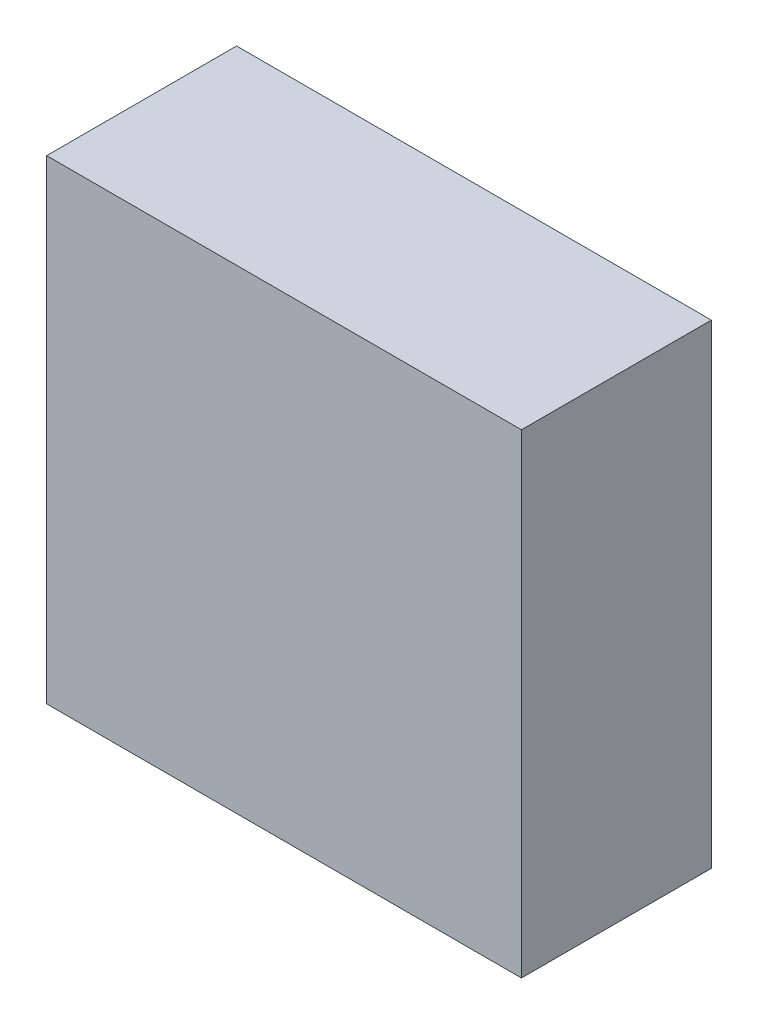
ISO-10303-21;
HEADER;
FILE_DESCRIPTION(('STEP AP214'),'2;1');
FILE_NAME('part.step','',(''),(''),'','','');
FILE_SCHEMA(('AUTOMOTIVE_DESIGN { 1 0 10303 214 1 1 1 1 }'));
ENDSEC;
DATA;
#1=APPLICATION_CONTEXT('core data for automotive mechanical design processes');
#2=APPLICATION_PROTOCOL_DEFINITION('international standard','automotive_design',2000,#1);
#3=PRODUCT_CONTEXT('',#1,'mechanical');
#4=PRODUCT('Part','Part','',(#3));
#5=PRODUCT_RELATED_PRODUCT_CATEGORY('part','',(#4));
#6=PRODUCT_DEFINITION_FORMATION('','',#4);
#7=PRODUCT_DEFINITION_CONTEXT('part definition',#1,'design');
#8=PRODUCT_DEFINITION('design','',#6,#7);
#9=PRODUCT_DEFINITION_SHAPE('','',#8);
#10=(LENGTH_UNIT() NAMED_UNIT(*) SI_UNIT(.MILLI.,.METRE.));
#11=(NAMED_UNIT(*) PLANE_ANGLE_UNIT() SI_UNIT($,.RADIAN.));
#12=(NAMED_UNIT(*) SI_UNIT($,.STERADIAN.) SOLID_ANGLE_UNIT());
#13=UNCERTAINTY_MEASURE_WITH_UNIT(LENGTH_MEASURE(1.E-05),#10,'distance_accuracy_value','');
#14=(GEOMETRIC_REPRESENTATION_CONTEXT(3) GLOBAL_UNCERTAINTY_ASSIGNED_CONTEXT((#13)) GLOBAL_UNIT_ASSIGNED_CONTEXT((#10,
#11,#12)) REPRESENTATION_CONTEXT('',''));
#15=CARTESIAN_POINT('',(0.,0.,0.));
#16=DIRECTION('',(0.,0.,1.));
#17=DIRECTION('',(1.,0.,0.));
#18=AXIS2_PLACEMENT_3D('',#15,#16,#17);
#19=CARTESIAN_POINT('',(0.,0.,0.));
#20=DIRECTION('',(0.,0.,-1.));
#21=DIRECTION('',(-1.,0.,0.));
#22=AXIS2_PLACEMENT_3D('',#19,#20,#21);
#23=PLANE('',#22);
#24=DIRECTION('',(0.,1.,0.));
#25=VECTOR('',#24,1.);
#26=CARTESIAN_POINT('',(7.5,-7.5,0.));
#27=LINE('',#26,#25);
#28=CARTESIAN_POINT('',(7.5,-7.5,0.));
#29=VERTEX_POINT('',#28);
#30=CARTESIAN_POINT('',(7.5,7.5,0.));
#31=VERTEX_POINT('',#30);
#32=EDGE_CURVE('E380',#29,#31,#27,.T.);
#33=ORIENTED_EDGE('',*,*,#32,.F.);
#34=DIRECTION('',(1.,0.,0.));
#35=VECTOR('',#34,1.);
#36=CARTESIAN_POINT('',(-7.5,-7.5,0.));
#37=LINE('',#36,#35);
#38=CARTESIAN_POINT('',(-7.5,-7.5,0.));
#39=VERTEX_POINT('',#38);
#40=EDGE_CURVE('E56',#39,#29,#37,.T.);
#41=ORIENTED_EDGE('',*,*,#40,.F.);
#42=DIRECTION('',(0.,-1.,0.));
#43=VECTOR('',#42,1.);
#44=CARTESIAN_POINT('',(-7.5,-7.5,0.));
#45=LINE('',#44,#43);
#46=CARTESIAN_POINT('',(-7.5,7.5,0.));
#47=VERTEX_POINT('',#46);
#48=EDGE_CURVE('E203',#47,#39,#45,.T.);
#49=ORIENTED_EDGE('',*,*,#48,.F.);
#50=DIRECTION('',(-1.,0.,0.));
#51=VECTOR('',#50,1.);
#52=CARTESIAN_POINT('',(-7.5,7.5,0.));
#53=LINE('',#52,#51);
#54=EDGE_CURVE('E383',#31,#47,#53,.T.);
#55=ORIENTED_EDGE('',*,*,#54,.F.);
#56=EDGE_LOOP('',(#33,#41,#49,#55));
#57=FACE_BOUND('',#56,.T.);
#58=DIRECTION('',(-1.,0.,0.));
#59=VECTOR('',#58,1.);
#60=CARTESIAN_POINT('',(-5.55,5.55,0.));
#61=LINE('',#60,#59);
#62=CARTESIAN_POINT('',(-1.5,5.55,0.));
#63=VERTEX_POINT('',#62);
#64=CARTESIAN_POINT('',(-5.55,5.55,0.));
#65=VERTEX_POINT('',#64);
#66=EDGE_CURVE('E226',#63,#65,#61,.T.);
#67=ORIENTED_EDGE('',*,*,#66,.T.);
#68=DIRECTION('',(0.,-1.,0.));
#69=VECTOR('',#68,1.);
#70=CARTESIAN_POINT('',(-5.55,5.55,0.));
#71=LINE('',#70,#69);
#72=CARTESIAN_POINT('',(-5.55,1.5,0.));
#73=VERTEX_POINT('',#72);
#74=EDGE_CURVE('E48',#65,#73,#71,.T.);
#75=ORIENTED_EDGE('',*,*,#74,.T.);
#76=DIRECTION('',(1.,0.,0.));
#77=VECTOR('',#76,1.);
#78=CARTESIAN_POINT('',(-5.55,1.5,0.));
#79=LINE('',#78,#77);
#80=CARTESIAN_POINT('',(-3.55,1.5,0.));
#81=VERTEX_POINT('',#80);
#82=EDGE_CURVE('E285',#73,#81,#79,.T.);
#83=ORIENTED_EDGE('',*,*,#82,.T.);
#84=DIRECTION('',(0.,-1.,0.));
#85=VECTOR('',#84,1.);
#86=CARTESIAN_POINT('',(-3.55,1.5,0.));
#87=LINE('',#86,#85);
#88=CARTESIAN_POINT('',(-3.55,-1.5,0.));
#89=VERTEX_POINT('',#88);
#90=EDGE_CURVE('E288',#81,#89,#87,.T.);
#91=ORIENTED_EDGE('',*,*,#90,.T.);
#92=DIRECTION('',(-1.,0.,0.));
#93=VECTOR('',#92,1.);
#94=CARTESIAN_POINT('',(-3.55,-1.5,0.));
#95=LINE('',#94,#93);
#96=CARTESIAN_POINT('',(-5.55,-1.5,0.));
#97=VERTEX_POINT('',#96);
#98=EDGE_CURVE('E291',#89,#97,#95,.T.);
#99=ORIENTED_EDGE('',*,*,#98,.T.);
#100=DIRECTION('',(0.,-1.,0.));
#101=VECTOR('',#100,1.);
#102=CARTESIAN_POINT('',(-5.55,-1.5,0.));
#103=LINE('',#102,#101);
#104=CARTESIAN_POINT('',(-5.55,-5.55,0.));
#105=VERTEX_POINT('',#104);
#106=EDGE_CURVE('E294',#97,#105,#103,.T.);
#107=ORIENTED_EDGE('',*,*,#106,.T.);
#108=DIRECTION('',(1.,0.,0.));
#109=VECTOR('',#108,1.);
#110=CARTESIAN_POINT('',(-5.55,-5.55,0.));
#111=LINE('',#110,#109);
#112=CARTESIAN_POINT('',(-1.5,-5.55,0.));
#113=VERTEX_POINT('',#112);
#114=EDGE_CURVE('E297',#105,#113,#111,.T.);
#115=ORIENTED_EDGE('',*,*,#114,.T.);
#116=DIRECTION('',(0.,1.,0.));
#117=VECTOR('',#116,1.);
#118=CARTESIAN_POINT('',(-1.5,-5.55,0.));
#119=LINE('',#118,#117);
#120=CARTESIAN_POINT('',(-1.5,-3.55,0.));
#121=VERTEX_POINT('',#120);
#122=EDGE_CURVE('E300',#113,#121,#119,.T.);
#123=ORIENTED_EDGE('',*,*,#122,.T.);
#124=DIRECTION('',(1.,0.,0.));
#125=VECTOR('',#124,1.);
#126=CARTESIAN_POINT('',(-1.5,-3.55,0.));
#127=LINE('',#126,#125);
#128=CARTESIAN_POINT('',(1.5,-3.55,0.));
#129=VERTEX_POINT('',#128);
#130=EDGE_CURVE('E303',#121,#129,#127,.T.);
#131=ORIENTED_EDGE('',*,*,#130,.T.);
#132=DIRECTION('',(0.,-1.,0.));
#133=VECTOR('',#132,1.);
#134=CARTESIAN_POINT('',(1.5,-3.55,0.));
#135=LINE('',#134,#133);
#136=CARTESIAN_POINT('',(1.5,-5.55,0.));
#137=VERTEX_POINT('',#136);
#138=EDGE_CURVE('E306',#129,#137,#135,.T.);
#139=ORIENTED_EDGE('',*,*,#138,.T.);
#140=DIRECTION('',(1.,0.,0.));
#141=VECTOR('',#140,1.);
#142=CARTESIAN_POINT('',(1.5,-5.55,0.));
#143=LINE('',#142,#141);
#144=CARTESIAN_POINT('',(5.55,-5.55,0.));
#145=VERTEX_POINT('',#144);
#146=EDGE_CURVE('E309',#137,#145,#143,.T.);
#147=ORIENTED_EDGE('',*,*,#146,.T.);
#148=DIRECTION('',(0.,1.,0.));
#149=VECTOR('',#148,1.);
#150=CARTESIAN_POINT('',(5.55,-5.55,0.));
#151=LINE('',#150,#149);
#152=CARTESIAN_POINT('',(5.55,-1.5,0.));
#153=VERTEX_POINT('',#152);
#154=EDGE_CURVE('E312',#145,#153,#151,.T.);
#155=ORIENTED_EDGE('',*,*,#154,.T.);
#156=DIRECTION('',(-1.,0.,0.));
#157=VECTOR('',#156,1.);
#158=CARTESIAN_POINT('',(5.55,-1.5,0.));
#159=LINE('',#158,#157);
#160=CARTESIAN_POINT('',(3.55,-1.5,0.));
#161=VERTEX_POINT('',#160);
#162=EDGE_CURVE('E315',#153,#161,#159,.T.);
#163=ORIENTED_EDGE('',*,*,#162,.T.);
#164=DIRECTION('',(0.,1.,0.));
#165=VECTOR('',#164,1.);
#166=CARTESIAN_POINT('',(3.55,-1.5,0.));
#167=LINE('',#166,#165);
#168=CARTESIAN_POINT('',(3.55,1.5,0.));
#169=VERTEX_POINT('',#168);
#170=EDGE_CURVE('E318',#161,#169,#167,.T.);
#171=ORIENTED_EDGE('',*,*,#170,.T.);
#172=DIRECTION('',(1.,0.,0.));
#173=VECTOR('',#172,1.);
#174=CARTESIAN_POINT('',(3.55,1.5,0.));
#175=LINE('',#174,#173);
#176=CARTESIAN_POINT('',(5.55,1.5,0.));
#177=VERTEX_POINT('',#176);
#178=EDGE_CURVE('E321',#169,#177,#175,.T.);
#179=ORIENTED_EDGE('',*,*,#178,.T.);
#180=DIRECTION('',(0.,1.,0.));
#181=VECTOR('',#180,1.);
#182=CARTESIAN_POINT('',(5.55,5.55,0.));
#183=LINE('',#182,#181);
#184=CARTESIAN_POINT('',(5.55,5.55,0.));
#185=VERTEX_POINT('',#184);
#186=EDGE_CURVE('E324',#177,#185,#183,.T.);
#187=ORIENTED_EDGE('',*,*,#186,.T.);
#188=DIRECTION('',(-1.,0.,0.));
#189=VECTOR('',#188,1.);
#190=CARTESIAN_POINT('',(1.5,5.55,0.));
#191=LINE('',#190,#189);
#192=CARTESIAN_POINT('',(1.5,5.55,0.));
#193=VERTEX_POINT('',#192);
#194=EDGE_CURVE('E327',#185,#193,#191,.T.);
#195=ORIENTED_EDGE('',*,*,#194,.T.);
#196=DIRECTION('',(0.,-1.,0.));
#197=VECTOR('',#196,1.);
#198=CARTESIAN_POINT('',(1.5,3.55,0.));
#199=LINE('',#198,#197);
#200=CARTESIAN_POINT('',(1.5,3.55,0.));
#201=VERTEX_POINT('',#200);
#202=EDGE_CURVE('E330',#193,#201,#199,.T.);
#203=ORIENTED_EDGE('',*,*,#202,.T.);
#204=DIRECTION('',(-1.,0.,0.));
#205=VECTOR('',#204,1.);
#206=CARTESIAN_POINT('',(-1.5,3.55,0.));
#207=LINE('',#206,#205);
#208=CARTESIAN_POINT('',(-1.5,3.55,0.));
#209=VERTEX_POINT('',#208);
#210=EDGE_CURVE('E333',#201,#209,#207,.T.);
#211=ORIENTED_EDGE('',*,*,#210,.T.);
#212=DIRECTION('',(0.,1.,0.));
#213=VECTOR('',#212,1.);
#214=CARTESIAN_POINT('',(-1.5,5.55,0.));
#215=LINE('',#214,#213);
#216=EDGE_CURVE('E336',#209,#63,#215,.T.);
#217=ORIENTED_EDGE('',*,*,#216,.T.);
#218=EDGE_LOOP('',(#67,#75,#83,#91,#99,#107,#115,#123,#131,#139,#147,#155,#163,#171,#179,#187,
#195,#203,#211,#217));
#219=FACE_BOUND('',#218,.T.);
#220=ADVANCED_FACE('F33',(#57,#219),#23,.T.);
#221=CARTESIAN_POINT('',(7.5,-7.5,5.));
#222=DIRECTION('',(-1.,0.,0.));
#223=DIRECTION('',(0.,0.,1.));
#224=AXIS2_PLACEMENT_3D('',#221,#222,#223);
#225=PLANE('',#224);
#226=ORIENTED_EDGE('',*,*,#32,.T.);
#227=DIRECTION('',(0.,0.,-1.));
#228=VECTOR('',#227,1.);
#229=CARTESIAN_POINT('',(7.5,7.5,5.));
#230=LINE('',#229,#228);
#231=CARTESIAN_POINT('',(7.5,7.5,6.));
#232=VERTEX_POINT('',#231);
#233=EDGE_CURVE('E11',#232,#31,#230,.T.);
#234=ORIENTED_EDGE('',*,*,#233,.F.);
#235=DIRECTION('',(0.,1.,0.));
#236=VECTOR('',#235,1.);
#237=CARTESIAN_POINT('',(7.5,7.5,6.));
#238=LINE('',#237,#236);
#239=CARTESIAN_POINT('',(7.5,-7.5,6.));
#240=VERTEX_POINT('',#239);
#241=EDGE_CURVE('E212',#240,#232,#238,.T.);
#242=ORIENTED_EDGE('',*,*,#241,.F.);
#243=DIRECTION('',(0.,0.,-1.));
#244=VECTOR('',#243,1.);
#245=CARTESIAN_POINT('',(7.5,-7.5,5.));
#246=LINE('',#245,#244);
#247=EDGE_CURVE('E204',#240,#29,#246,.T.);
#248=ORIENTED_EDGE('',*,*,#247,.T.);
#249=EDGE_LOOP('',(#226,#234,#242,#248));
#250=FACE_BOUND('',#249,.T.);
#251=ADVANCED_FACE('F35',(#250),#225,.F.);
#252=CARTESIAN_POINT('',(-7.5,7.5,5.));
#253=DIRECTION('',(0.,-1.,0.));
#254=DIRECTION('',(0.,0.,-1.));
#255=AXIS2_PLACEMENT_3D('',#252,#253,#254);
#256=PLANE('',#255);
#257=ORIENTED_EDGE('',*,*,#54,.T.);
#258=DIRECTION('',(0.,0.,-1.));
#259=VECTOR('',#258,1.);
#260=CARTESIAN_POINT('',(-7.5,7.5,5.));
#261=LINE('',#260,#259);
#262=CARTESIAN_POINT('',(-7.5,7.5,6.));
#263=VERTEX_POINT('',#262);
#264=EDGE_CURVE('E41',#263,#47,#261,.T.);
#265=ORIENTED_EDGE('',*,*,#264,.F.);
#266=DIRECTION('',(-1.,0.,0.));
#267=VECTOR('',#266,1.);
#268=CARTESIAN_POINT('',(-7.5,7.5,6.));
#269=LINE('',#268,#267);
#270=EDGE_CURVE('E217',#232,#263,#269,.T.);
#271=ORIENTED_EDGE('',*,*,#270,.F.);
#272=ORIENTED_EDGE('',*,*,#233,.T.);
#273=EDGE_LOOP('',(#257,#265,#271,#272));
#274=FACE_BOUND('',#273,.T.);
#275=ADVANCED_FACE('F392',(#274),#256,.F.);
#276=CARTESIAN_POINT('',(-7.5,-7.5,5.));
#277=DIRECTION('',(1.,0.,0.));
#278=DIRECTION('',(0.,0.,-1.));
#279=AXIS2_PLACEMENT_3D('',#276,#277,#278);
#280=PLANE('',#279);
#281=ORIENTED_EDGE('',*,*,#48,.T.);
#282=DIRECTION('',(0.,0.,-1.));
#283=VECTOR('',#282,1.);
#284=CARTESIAN_POINT('',(-7.5,-7.5,5.));
#285=LINE('',#284,#283);
#286=CARTESIAN_POINT('',(-7.5,-7.5,6.));
#287=VERTEX_POINT('',#286);
#288=EDGE_CURVE('E196',#287,#39,#285,.T.);
#289=ORIENTED_EDGE('',*,*,#288,.F.);
#290=DIRECTION('',(0.,-1.,0.));
#291=VECTOR('',#290,1.);
#292=CARTESIAN_POINT('',(-7.5,7.5,6.));
#293=LINE('',#292,#291);
#294=EDGE_CURVE('E201',#263,#287,#293,.T.);
#295=ORIENTED_EDGE('',*,*,#294,.F.);
#296=ORIENTED_EDGE('',*,*,#264,.T.);
#297=EDGE_LOOP('',(#281,#289,#295,#296));
#298=FACE_BOUND('',#297,.T.);
#299=ADVANCED_FACE('F198',(#298),#280,.F.);
#300=CARTESIAN_POINT('',(-7.5,-7.5,5.));
#301=DIRECTION('',(0.,1.,0.));
#302=DIRECTION('',(0.,0.,1.));
#303=AXIS2_PLACEMENT_3D('',#300,#301,#302);
#304=PLANE('',#303);
#305=ORIENTED_EDGE('',*,*,#40,.T.);
#306=ORIENTED_EDGE('',*,*,#247,.F.);
#307=DIRECTION('',(1.,0.,0.));
#308=VECTOR('',#307,1.);
#309=CARTESIAN_POINT('',(-7.5,-7.5,6.));
#310=LINE('',#309,#308);
#311=EDGE_CURVE('E207',#287,#240,#310,.T.);
#312=ORIENTED_EDGE('',*,*,#311,.F.);
#313=ORIENTED_EDGE('',*,*,#288,.T.);
#314=EDGE_LOOP('',(#305,#306,#312,#313));
#315=FACE_BOUND('',#314,.T.);
#316=ADVANCED_FACE('F208',(#315),#304,.F.);
#317=CARTESIAN_POINT('',(-5.55,5.55,5.));
#318=DIRECTION('',(1.,0.,0.));
#319=DIRECTION('',(0.,0.,-1.));
#320=AXIS2_PLACEMENT_3D('',#317,#318,#319);
#321=PLANE('',#320);
#322=ORIENTED_EDGE('',*,*,#74,.F.);
#323=DIRECTION('',(0.,0.,-1.));
#324=VECTOR('',#323,1.);
#325=CARTESIAN_POINT('',(-5.55,5.55,5.));
#326=LINE('',#325,#324);
#327=CARTESIAN_POINT('',(-5.55,5.55,5.));
#328=VERTEX_POINT('',#327);
#329=EDGE_CURVE('E283',#328,#65,#326,.T.);
#330=ORIENTED_EDGE('',*,*,#329,.F.);
#331=DIRECTION('',(0.,-1.,0.));
#332=VECTOR('',#331,1.);
#333=CARTESIAN_POINT('',(-5.55,5.55,5.));
#334=LINE('',#333,#332);
#335=CARTESIAN_POINT('',(-5.55,1.5,5.));
#336=VERTEX_POINT('',#335);
#337=EDGE_CURVE('E222',#328,#336,#334,.T.);
#338=ORIENTED_EDGE('',*,*,#337,.T.);
#339=DIRECTION('',(0.,0.,-1.));
#340=VECTOR('',#339,1.);
#341=CARTESIAN_POINT('',(-5.55,1.5,5.));
#342=LINE('',#341,#340);
#343=EDGE_CURVE('E378',#336,#73,#342,.T.);
#344=ORIENTED_EDGE('',*,*,#343,.T.);
#345=EDGE_LOOP('',(#322,#330,#338,#344));
#346=FACE_BOUND('',#345,.T.);
#347=ADVANCED_FACE('F405',(#346),#321,.T.);
#348=CARTESIAN_POINT('',(-5.55,1.5,5.));
#349=DIRECTION('',(0.,1.,0.));
#350=DIRECTION('',(0.,0.,1.));
#351=AXIS2_PLACEMENT_3D('',#348,#349,#350);
#352=PLANE('',#351);
#353=ORIENTED_EDGE('',*,*,#82,.F.);
#354=ORIENTED_EDGE('',*,*,#343,.F.);
#355=DIRECTION('',(1.,0.,0.));
#356=VECTOR('',#355,1.);
#357=CARTESIAN_POINT('',(-5.55,1.5,5.));
#358=LINE('',#357,#356);
#359=CARTESIAN_POINT('',(-3.55,1.5,5.));
#360=VERTEX_POINT('',#359);
#361=EDGE_CURVE('E225',#336,#360,#358,.T.);
#362=ORIENTED_EDGE('',*,*,#361,.T.);
#363=DIRECTION('',(0.,0.,-1.));
#364=VECTOR('',#363,1.);
#365=CARTESIAN_POINT('',(-3.55,1.5,5.));
#366=LINE('',#365,#364);
#367=EDGE_CURVE('E376',#360,#81,#366,.T.);
#368=ORIENTED_EDGE('',*,*,#367,.T.);
#369=EDGE_LOOP('',(#353,#354,#362,#368));
#370=FACE_BOUND('',#369,.T.);
#371=ADVANCED_FACE('F411',(#370),#352,.T.);
#372=CARTESIAN_POINT('',(-3.55,1.5,5.));
#373=DIRECTION('',(1.,0.,0.));
#374=DIRECTION('',(0.,1.,0.));
#375=AXIS2_PLACEMENT_3D('',#372,#373,#374);
#376=PLANE('',#375);
#377=ORIENTED_EDGE('',*,*,#90,.F.);
#378=ORIENTED_EDGE('',*,*,#367,.F.);
#379=DIRECTION('',(0.,-1.,0.));
#380=VECTOR('',#379,1.);
#381=CARTESIAN_POINT('',(-3.55,1.5,5.));
#382=LINE('',#381,#380);
#383=CARTESIAN_POINT('',(-3.55,-1.5,5.));
#384=VERTEX_POINT('',#383);
#385=EDGE_CURVE('E229',#360,#384,#382,.T.);
#386=ORIENTED_EDGE('',*,*,#385,.T.);
#387=DIRECTION('',(0.,0.,-1.));
#388=VECTOR('',#387,1.);
#389=CARTESIAN_POINT('',(-3.55,-1.5,5.));
#390=LINE('',#389,#388);
#391=EDGE_CURVE('E374',#384,#89,#390,.T.);
#392=ORIENTED_EDGE('',*,*,#391,.T.);
#393=EDGE_LOOP('',(#377,#378,#386,#392));
#394=FACE_BOUND('',#393,.T.);
#395=ADVANCED_FACE('F415',(#394),#376,.T.);
#396=CARTESIAN_POINT('',(-3.55,-1.5,5.));
#397=DIRECTION('',(0.,-1.,0.));
#398=DIRECTION('',(1.,0.,0.));
#399=AXIS2_PLACEMENT_3D('',#396,#397,#398);
#400=PLANE('',#399);
#401=ORIENTED_EDGE('',*,*,#98,.F.);
#402=ORIENTED_EDGE('',*,*,#391,.F.);
#403=DIRECTION('',(-1.,0.,0.));
#404=VECTOR('',#403,1.);
#405=CARTESIAN_POINT('',(-3.55,-1.5,5.));
#406=LINE('',#405,#404);
#407=CARTESIAN_POINT('',(-5.55,-1.5,5.));
#408=VERTEX_POINT('',#407);
#409=EDGE_CURVE('E232',#384,#408,#406,.T.);
#410=ORIENTED_EDGE('',*,*,#409,.T.);
#411=DIRECTION('',(0.,0.,-1.));
#412=VECTOR('',#411,1.);
#413=CARTESIAN_POINT('',(-5.55,-1.5,5.));
#414=LINE('',#413,#412);
#415=EDGE_CURVE('E372',#408,#97,#414,.T.);
#416=ORIENTED_EDGE('',*,*,#415,.T.);
#417=EDGE_LOOP('',(#401,#402,#410,#416));
#418=FACE_BOUND('',#417,.T.);
#419=ADVANCED_FACE('F420',(#418),#400,.T.);
#420=CARTESIAN_POINT('',(-5.55,-1.5,5.));
#421=DIRECTION('',(1.,0.,0.));
#422=DIRECTION('',(0.,0.,-1.));
#423=AXIS2_PLACEMENT_3D('',#420,#421,#422);
#424=PLANE('',#423);
#425=ORIENTED_EDGE('',*,*,#106,.F.);
#426=ORIENTED_EDGE('',*,*,#415,.F.);
#427=DIRECTION('',(0.,-1.,0.));
#428=VECTOR('',#427,1.);
#429=CARTESIAN_POINT('',(-5.55,-1.5,5.));
#430=LINE('',#429,#428);
#431=CARTESIAN_POINT('',(-5.55,-5.55,5.));
#432=VERTEX_POINT('',#431);
#433=EDGE_CURVE('E235',#408,#432,#430,.T.);
#434=ORIENTED_EDGE('',*,*,#433,.T.);
#435=DIRECTION('',(0.,0.,-1.));
#436=VECTOR('',#435,1.);
#437=CARTESIAN_POINT('',(-5.55,-5.55,5.));
#438=LINE('',#437,#436);
#439=EDGE_CURVE('E370',#432,#105,#438,.T.);
#440=ORIENTED_EDGE('',*,*,#439,.T.);
#441=EDGE_LOOP('',(#425,#426,#434,#440));
#442=FACE_BOUND('',#441,.T.);
#443=ADVANCED_FACE('F426',(#442),#424,.T.);
#444=CARTESIAN_POINT('',(-5.55,-5.55,5.));
#445=DIRECTION('',(0.,1.,0.));
#446=DIRECTION('',(-1.,0.,0.));
#447=AXIS2_PLACEMENT_3D('',#444,#445,#446);
#448=PLANE('',#447);
#449=ORIENTED_EDGE('',*,*,#114,.F.);
#450=ORIENTED_EDGE('',*,*,#439,.F.);
#451=DIRECTION('',(1.,0.,0.));
#452=VECTOR('',#451,1.);
#453=CARTESIAN_POINT('',(-5.55,-5.55,5.));
#454=LINE('',#453,#452);
#455=CARTESIAN_POINT('',(-1.5,-5.55,5.));
#456=VERTEX_POINT('',#455);
#457=EDGE_CURVE('E238',#432,#456,#454,.T.);
#458=ORIENTED_EDGE('',*,*,#457,.T.);
#459=DIRECTION('',(0.,0.,-1.));
#460=VECTOR('',#459,1.);
#461=CARTESIAN_POINT('',(-1.5,-5.55,5.));
#462=LINE('',#461,#460);
#463=EDGE_CURVE('E368',#456,#113,#462,.T.);
#464=ORIENTED_EDGE('',*,*,#463,.T.);
#465=EDGE_LOOP('',(#449,#450,#458,#464));
#466=FACE_BOUND('',#465,.T.);
#467=ADVANCED_FACE('F430',(#466),#448,.T.);
#468=CARTESIAN_POINT('',(-1.5,-5.55,5.));
#469=DIRECTION('',(-1.,0.,0.));
#470=DIRECTION('',(0.,0.,1.));
#471=AXIS2_PLACEMENT_3D('',#468,#469,#470);
#472=PLANE('',#471);
#473=ORIENTED_EDGE('',*,*,#122,.F.);
#474=ORIENTED_EDGE('',*,*,#463,.F.);
#475=DIRECTION('',(0.,1.,0.));
#476=VECTOR('',#475,1.);
#477=CARTESIAN_POINT('',(-1.5,-5.55,5.));
#478=LINE('',#477,#476);
#479=CARTESIAN_POINT('',(-1.5,-3.55,5.));
#480=VERTEX_POINT('',#479);
#481=EDGE_CURVE('E241',#456,#480,#478,.T.);
#482=ORIENTED_EDGE('',*,*,#481,.T.);
#483=DIRECTION('',(0.,0.,-1.));
#484=VECTOR('',#483,1.);
#485=CARTESIAN_POINT('',(-1.5,-3.55,5.));
#486=LINE('',#485,#484);
#487=EDGE_CURVE('E366',#480,#121,#486,.T.);
#488=ORIENTED_EDGE('',*,*,#487,.T.);
#489=EDGE_LOOP('',(#473,#474,#482,#488));
#490=FACE_BOUND('',#489,.T.);
#491=ADVANCED_FACE('F434',(#490),#472,.T.);
#492=CARTESIAN_POINT('',(-1.5,-3.55,5.));
#493=DIRECTION('',(0.,1.,0.));
#494=DIRECTION('',(0.,0.,1.));
#495=AXIS2_PLACEMENT_3D('',#492,#493,#494);
#496=PLANE('',#495);
#497=ORIENTED_EDGE('',*,*,#130,.F.);
#498=ORIENTED_EDGE('',*,*,#487,.F.);
#499=DIRECTION('',(1.,0.,0.));
#500=VECTOR('',#499,1.);
#501=CARTESIAN_POINT('',(-1.5,-3.55,5.));
#502=LINE('',#501,#500);
#503=CARTESIAN_POINT('',(1.5,-3.55,5.));
#504=VERTEX_POINT('',#503);
#505=EDGE_CURVE('E244',#480,#504,#502,.T.);
#506=ORIENTED_EDGE('',*,*,#505,.T.);
#507=DIRECTION('',(0.,0.,-1.));
#508=VECTOR('',#507,1.);
#509=CARTESIAN_POINT('',(1.5,-3.55,5.));
#510=LINE('',#509,#508);
#511=EDGE_CURVE('E364',#504,#129,#510,.T.);
#512=ORIENTED_EDGE('',*,*,#511,.T.);
#513=EDGE_LOOP('',(#497,#498,#506,#512));
#514=FACE_BOUND('',#513,.T.);
#515=ADVANCED_FACE('F438',(#514),#496,.T.);
#516=CARTESIAN_POINT('',(1.5,-3.55,5.));
#517=DIRECTION('',(1.,0.,0.));
#518=DIRECTION('',(0.,0.,-1.));
#519=AXIS2_PLACEMENT_3D('',#516,#517,#518);
#520=PLANE('',#519);
#521=ORIENTED_EDGE('',*,*,#138,.F.);
#522=ORIENTED_EDGE('',*,*,#511,.F.);
#523=DIRECTION('',(0.,-1.,0.));
#524=VECTOR('',#523,1.);
#525=CARTESIAN_POINT('',(1.5,-3.55,5.));
#526=LINE('',#525,#524);
#527=CARTESIAN_POINT('',(1.5,-5.55,5.));
#528=VERTEX_POINT('',#527);
#529=EDGE_CURVE('E247',#504,#528,#526,.T.);
#530=ORIENTED_EDGE('',*,*,#529,.T.);
#531=DIRECTION('',(0.,0.,-1.));
#532=VECTOR('',#531,1.);
#533=CARTESIAN_POINT('',(1.5,-5.55,5.));
#534=LINE('',#533,#532);
#535=EDGE_CURVE('E362',#528,#137,#534,.T.);
#536=ORIENTED_EDGE('',*,*,#535,.T.);
#537=EDGE_LOOP('',(#521,#522,#530,#536));
#538=FACE_BOUND('',#537,.T.);
#539=ADVANCED_FACE('F442',(#538),#520,.T.);
#540=CARTESIAN_POINT('',(1.5,-5.55,5.));
#541=DIRECTION('',(0.,1.,0.));
#542=DIRECTION('',(0.,0.,1.));
#543=AXIS2_PLACEMENT_3D('',#540,#541,#542);
#544=PLANE('',#543);
#545=ORIENTED_EDGE('',*,*,#146,.F.);
#546=ORIENTED_EDGE('',*,*,#535,.F.);
#547=DIRECTION('',(1.,0.,0.));
#548=VECTOR('',#547,1.);
#549=CARTESIAN_POINT('',(1.5,-5.55,5.));
#550=LINE('',#549,#548);
#551=CARTESIAN_POINT('',(5.55,-5.55,5.));
#552=VERTEX_POINT('',#551);
#553=EDGE_CURVE('E250',#528,#552,#550,.T.);
#554=ORIENTED_EDGE('',*,*,#553,.T.);
#555=DIRECTION('',(0.,0.,-1.));
#556=VECTOR('',#555,1.);
#557=CARTESIAN_POINT('',(5.55,-5.55,5.));
#558=LINE('',#557,#556);
#559=EDGE_CURVE('E360',#552,#145,#558,.T.);
#560=ORIENTED_EDGE('',*,*,#559,.T.);
#561=EDGE_LOOP('',(#545,#546,#554,#560));
#562=FACE_BOUND('',#561,.T.);
#563=ADVANCED_FACE('F446',(#562),#544,.T.);
#564=CARTESIAN_POINT('',(5.55,-5.55,5.));
#565=DIRECTION('',(-1.,0.,0.));
#566=DIRECTION('',(0.,0.,1.));
#567=AXIS2_PLACEMENT_3D('',#564,#565,#566);
#568=PLANE('',#567);
#569=ORIENTED_EDGE('',*,*,#154,.F.);
#570=ORIENTED_EDGE('',*,*,#559,.F.);
#571=DIRECTION('',(0.,1.,0.));
#572=VECTOR('',#571,1.);
#573=CARTESIAN_POINT('',(5.55,-5.55,5.));
#574=LINE('',#573,#572);
#575=CARTESIAN_POINT('',(5.55,-1.5,5.));
#576=VERTEX_POINT('',#575);
#577=EDGE_CURVE('E253',#552,#576,#574,.T.);
#578=ORIENTED_EDGE('',*,*,#577,.T.);
#579=DIRECTION('',(0.,0.,-1.));
#580=VECTOR('',#579,1.);
#581=CARTESIAN_POINT('',(5.55,-1.5,5.));
#582=LINE('',#581,#580);
#583=EDGE_CURVE('E358',#576,#153,#582,.T.);
#584=ORIENTED_EDGE('',*,*,#583,.T.);
#585=EDGE_LOOP('',(#569,#570,#578,#584));
#586=FACE_BOUND('',#585,.T.);
#587=ADVANCED_FACE('F450',(#586),#568,.T.);
#588=CARTESIAN_POINT('',(5.55,-1.5,5.));
#589=DIRECTION('',(0.,-1.,0.));
#590=DIRECTION('',(1.,0.,0.));
#591=AXIS2_PLACEMENT_3D('',#588,#589,#590);
#592=PLANE('',#591);
#593=ORIENTED_EDGE('',*,*,#162,.F.);
#594=ORIENTED_EDGE('',*,*,#583,.F.);
#595=DIRECTION('',(-1.,0.,0.));
#596=VECTOR('',#595,1.);
#597=CARTESIAN_POINT('',(5.55,-1.5,5.));
#598=LINE('',#597,#596);
#599=CARTESIAN_POINT('',(3.55,-1.5,5.));
#600=VERTEX_POINT('',#599);
#601=EDGE_CURVE('E256',#576,#600,#598,.T.);
#602=ORIENTED_EDGE('',*,*,#601,.T.);
#603=DIRECTION('',(0.,0.,-1.));
#604=VECTOR('',#603,1.);
#605=CARTESIAN_POINT('',(3.55,-1.5,5.));
#606=LINE('',#605,#604);
#607=EDGE_CURVE('E356',#600,#161,#606,.T.);
#608=ORIENTED_EDGE('',*,*,#607,.T.);
#609=EDGE_LOOP('',(#593,#594,#602,#608));
#610=FACE_BOUND('',#609,.T.);
#611=ADVANCED_FACE('F454',(#610),#592,.T.);
#612=CARTESIAN_POINT('',(3.55,-1.5,5.));
#613=DIRECTION('',(-1.,0.,0.));
#614=DIRECTION('',(0.,0.,1.));
#615=AXIS2_PLACEMENT_3D('',#612,#613,#614);
#616=PLANE('',#615);
#617=ORIENTED_EDGE('',*,*,#170,.F.);
#618=ORIENTED_EDGE('',*,*,#607,.F.);
#619=DIRECTION('',(0.,1.,0.));
#620=VECTOR('',#619,1.);
#621=CARTESIAN_POINT('',(3.55,-1.5,5.));
#622=LINE('',#621,#620);
#623=CARTESIAN_POINT('',(3.55,1.5,5.));
#624=VERTEX_POINT('',#623);
#625=EDGE_CURVE('E259',#600,#624,#622,.T.);
#626=ORIENTED_EDGE('',*,*,#625,.T.);
#627=DIRECTION('',(0.,0.,-1.));
#628=VECTOR('',#627,1.);
#629=CARTESIAN_POINT('',(3.55,1.5,5.));
#630=LINE('',#629,#628);
#631=EDGE_CURVE('E354',#624,#169,#630,.T.);
#632=ORIENTED_EDGE('',*,*,#631,.T.);
#633=EDGE_LOOP('',(#617,#618,#626,#632));
#634=FACE_BOUND('',#633,.T.);
#635=ADVANCED_FACE('F458',(#634),#616,.T.);
#636=CARTESIAN_POINT('',(3.55,1.5,5.));
#637=DIRECTION('',(0.,1.,0.));
#638=DIRECTION('',(0.,0.,1.));
#639=AXIS2_PLACEMENT_3D('',#636,#637,#638);
#640=PLANE('',#639);
#641=ORIENTED_EDGE('',*,*,#178,.F.);
#642=ORIENTED_EDGE('',*,*,#631,.F.);
#643=DIRECTION('',(1.,0.,0.));
#644=VECTOR('',#643,1.);
#645=CARTESIAN_POINT('',(3.55,1.5,5.));
#646=LINE('',#645,#644);
#647=CARTESIAN_POINT('',(5.55,1.5,5.));
#648=VERTEX_POINT('',#647);
#649=EDGE_CURVE('E262',#624,#648,#646,.T.);
#650=ORIENTED_EDGE('',*,*,#649,.T.);
#651=DIRECTION('',(0.,0.,-1.));
#652=VECTOR('',#651,1.);
#653=CARTESIAN_POINT('',(5.55,1.5,5.));
#654=LINE('',#653,#652);
#655=EDGE_CURVE('E352',#648,#177,#654,.T.);
#656=ORIENTED_EDGE('',*,*,#655,.T.);
#657=EDGE_LOOP('',(#641,#642,#650,#656));
#658=FACE_BOUND('',#657,.T.);
#659=ADVANCED_FACE('F462',(#658),#640,.T.);
#660=CARTESIAN_POINT('',(5.55,5.55,5.));
#661=DIRECTION('',(-1.,0.,0.));
#662=DIRECTION('',(0.,0.,1.));
#663=AXIS2_PLACEMENT_3D('',#660,#661,#662);
#664=PLANE('',#663);
#665=ORIENTED_EDGE('',*,*,#186,.F.);
#666=ORIENTED_EDGE('',*,*,#655,.F.);
#667=DIRECTION('',(0.,1.,0.));
#668=VECTOR('',#667,1.);
#669=CARTESIAN_POINT('',(5.55,5.55,5.));
#670=LINE('',#669,#668);
#671=CARTESIAN_POINT('',(5.55,5.55,5.));
#672=VERTEX_POINT('',#671);
#673=EDGE_CURVE('E265',#648,#672,#670,.T.);
#674=ORIENTED_EDGE('',*,*,#673,.T.);
#675=DIRECTION('',(0.,0.,-1.));
#676=VECTOR('',#675,1.);
#677=CARTESIAN_POINT('',(5.55,5.55,5.));
#678=LINE('',#677,#676);
#679=EDGE_CURVE('E350',#672,#185,#678,.T.);
#680=ORIENTED_EDGE('',*,*,#679,.T.);
#681=EDGE_LOOP('',(#665,#666,#674,#680));
#682=FACE_BOUND('',#681,.T.);
#683=ADVANCED_FACE('F466',(#682),#664,.T.);
#684=CARTESIAN_POINT('',(1.5,5.55,5.));
#685=DIRECTION('',(0.,-1.,0.));
#686=DIRECTION('',(0.,0.,-1.));
#687=AXIS2_PLACEMENT_3D('',#684,#685,#686);
#688=PLANE('',#687);
#689=ORIENTED_EDGE('',*,*,#194,.F.);
#690=ORIENTED_EDGE('',*,*,#679,.F.);
#691=DIRECTION('',(-1.,0.,0.));
#692=VECTOR('',#691,1.);
#693=CARTESIAN_POINT('',(1.5,5.55,5.));
#694=LINE('',#693,#692);
#695=CARTESIAN_POINT('',(1.5,5.55,5.));
#696=VERTEX_POINT('',#695);
#697=EDGE_CURVE('E268',#672,#696,#694,.T.);
#698=ORIENTED_EDGE('',*,*,#697,.T.);
#699=DIRECTION('',(0.,0.,-1.));
#700=VECTOR('',#699,1.);
#701=CARTESIAN_POINT('',(1.5,5.55,5.));
#702=LINE('',#701,#700);
#703=EDGE_CURVE('E348',#696,#193,#702,.T.);
#704=ORIENTED_EDGE('',*,*,#703,.T.);
#705=EDGE_LOOP('',(#689,#690,#698,#704));
#706=FACE_BOUND('',#705,.T.);
#707=ADVANCED_FACE('F470',(#706),#688,.T.);
#708=CARTESIAN_POINT('',(1.5,3.55,5.));
#709=DIRECTION('',(1.,0.,0.));
#710=DIRECTION('',(0.,1.,0.));
#711=AXIS2_PLACEMENT_3D('',#708,#709,#710);
#712=PLANE('',#711);
#713=ORIENTED_EDGE('',*,*,#202,.F.);
#714=ORIENTED_EDGE('',*,*,#703,.F.);
#715=DIRECTION('',(0.,-1.,0.));
#716=VECTOR('',#715,1.);
#717=CARTESIAN_POINT('',(1.5,3.55,5.));
#718=LINE('',#717,#716);
#719=CARTESIAN_POINT('',(1.5,3.55,5.));
#720=VERTEX_POINT('',#719);
#721=EDGE_CURVE('E271',#696,#720,#718,.T.);
#722=ORIENTED_EDGE('',*,*,#721,.T.);
#723=DIRECTION('',(0.,0.,-1.));
#724=VECTOR('',#723,1.);
#725=CARTESIAN_POINT('',(1.5,3.55,5.));
#726=LINE('',#725,#724);
#727=EDGE_CURVE('E346',#720,#201,#726,.T.);
#728=ORIENTED_EDGE('',*,*,#727,.T.);
#729=EDGE_LOOP('',(#713,#714,#722,#728));
#730=FACE_BOUND('',#729,.T.);
#731=ADVANCED_FACE('F474',(#730),#712,.T.);
#732=CARTESIAN_POINT('',(-1.5,3.55,5.));
#733=DIRECTION('',(0.,-1.,0.));
#734=DIRECTION('',(0.,0.,-1.));
#735=AXIS2_PLACEMENT_3D('',#732,#733,#734);
#736=PLANE('',#735);
#737=ORIENTED_EDGE('',*,*,#210,.F.);
#738=ORIENTED_EDGE('',*,*,#727,.F.);
#739=DIRECTION('',(-1.,0.,0.));
#740=VECTOR('',#739,1.);
#741=CARTESIAN_POINT('',(-1.5,3.55,5.));
#742=LINE('',#741,#740);
#743=CARTESIAN_POINT('',(-1.5,3.55,5.));
#744=VERTEX_POINT('',#743);
#745=EDGE_CURVE('E274',#720,#744,#742,.T.);
#746=ORIENTED_EDGE('',*,*,#745,.T.);
#747=DIRECTION('',(0.,0.,-1.));
#748=VECTOR('',#747,1.);
#749=CARTESIAN_POINT('',(-1.5,3.55,5.));
#750=LINE('',#749,#748);
#751=EDGE_CURVE('E344',#744,#209,#750,.T.);
#752=ORIENTED_EDGE('',*,*,#751,.T.);
#753=EDGE_LOOP('',(#737,#738,#746,#752));
#754=FACE_BOUND('',#753,.T.);
#755=ADVANCED_FACE('F478',(#754),#736,.T.);
#756=CARTESIAN_POINT('',(-1.5,5.55,5.));
#757=DIRECTION('',(-1.,0.,0.));
#758=DIRECTION('',(0.,-1.,0.));
#759=AXIS2_PLACEMENT_3D('',#756,#757,#758);
#760=PLANE('',#759);
#761=ORIENTED_EDGE('',*,*,#216,.F.);
#762=ORIENTED_EDGE('',*,*,#751,.F.);
#763=DIRECTION('',(0.,1.,0.));
#764=VECTOR('',#763,1.);
#765=CARTESIAN_POINT('',(-1.5,5.55,5.));
#766=LINE('',#765,#764);
#767=CARTESIAN_POINT('',(-1.5,5.55,5.));
#768=VERTEX_POINT('',#767);
#769=EDGE_CURVE('E277',#744,#768,#766,.T.);
#770=ORIENTED_EDGE('',*,*,#769,.T.);
#771=DIRECTION('',(0.,0.,-1.));
#772=VECTOR('',#771,1.);
#773=CARTESIAN_POINT('',(-1.5,5.55,5.));
#774=LINE('',#773,#772);
#775=EDGE_CURVE('E342',#768,#63,#774,.T.);
#776=ORIENTED_EDGE('',*,*,#775,.T.);
#777=EDGE_LOOP('',(#761,#762,#770,#776));
#778=FACE_BOUND('',#777,.T.);
#779=ADVANCED_FACE('F482',(#778),#760,.T.);
#780=CARTESIAN_POINT('',(-5.55,5.55,5.));
#781=DIRECTION('',(0.,-1.,0.));
#782=DIRECTION('',(0.,0.,-1.));
#783=AXIS2_PLACEMENT_3D('',#780,#781,#782);
#784=PLANE('',#783);
#785=ORIENTED_EDGE('',*,*,#66,.F.);
#786=ORIENTED_EDGE('',*,*,#775,.F.);
#787=DIRECTION('',(-1.,0.,0.));
#788=VECTOR('',#787,1.);
#789=CARTESIAN_POINT('',(-5.55,5.55,5.));
#790=LINE('',#789,#788);
#791=EDGE_CURVE('E280',#768,#328,#790,.T.);
#792=ORIENTED_EDGE('',*,*,#791,.T.);
#793=ORIENTED_EDGE('',*,*,#329,.T.);
#794=EDGE_LOOP('',(#785,#786,#792,#793));
#795=FACE_BOUND('',#794,.T.);
#796=ADVANCED_FACE('F486',(#795),#784,.T.);
#797=CARTESIAN_POINT('',(0.,0.,5.));
#798=DIRECTION('',(0.,0.,1.));
#799=DIRECTION('',(1.,0.,0.));
#800=AXIS2_PLACEMENT_3D('',#797,#798,#799);
#801=PLANE('',#800);
#802=ORIENTED_EDGE('',*,*,#337,.F.);
#803=ORIENTED_EDGE('',*,*,#791,.F.);
#804=ORIENTED_EDGE('',*,*,#769,.F.);
#805=ORIENTED_EDGE('',*,*,#745,.F.);
#806=ORIENTED_EDGE('',*,*,#721,.F.);
#807=ORIENTED_EDGE('',*,*,#697,.F.);
#808=ORIENTED_EDGE('',*,*,#673,.F.);
#809=ORIENTED_EDGE('',*,*,#649,.F.);
#810=ORIENTED_EDGE('',*,*,#625,.F.);
#811=ORIENTED_EDGE('',*,*,#601,.F.);
#812=ORIENTED_EDGE('',*,*,#577,.F.);
#813=ORIENTED_EDGE('',*,*,#553,.F.);
#814=ORIENTED_EDGE('',*,*,#529,.F.);
#815=ORIENTED_EDGE('',*,*,#505,.F.);
#816=ORIENTED_EDGE('',*,*,#481,.F.);
#817=ORIENTED_EDGE('',*,*,#457,.F.);
#818=ORIENTED_EDGE('',*,*,#433,.F.);
#819=ORIENTED_EDGE('',*,*,#409,.F.);
#820=ORIENTED_EDGE('',*,*,#385,.F.);
#821=ORIENTED_EDGE('',*,*,#361,.F.);
#822=EDGE_LOOP('',(#802,#803,#804,#805,#806,#807,#808,#809,#810,#811,#812,#813,#814,#815,#816,
#817,#818,#819,#820,#821));
#823=FACE_BOUND('',#822,.T.);
#824=ADVANCED_FACE('F490',(#823),#801,.F.);
#825=CARTESIAN_POINT('',(0.,0.,6.));
#826=DIRECTION('',(0.,0.,1.));
#827=DIRECTION('',(1.,0.,0.));
#828=AXIS2_PLACEMENT_3D('',#825,#826,#827);
#829=PLANE('',#828);
#830=ORIENTED_EDGE('',*,*,#294,.T.);
#831=ORIENTED_EDGE('',*,*,#311,.T.);
#832=ORIENTED_EDGE('',*,*,#241,.T.);
#833=ORIENTED_EDGE('',*,*,#270,.T.);
#834=EDGE_LOOP('',(#830,#831,#832,#833));
#835=FACE_BOUND('',#834,.T.);
#836=ADVANCED_FACE('F215',(#835),#829,.T.);
#837=CLOSED_SHELL('',(#220,#251,#275,#299,#316,#347,#371,#395,#419,#443,#467,#491,#515,#539,
#563,#587,#611,#635,#659,#683,#707,#731,#755,#779,#796,#824,#836));
#838=MANIFOLD_SOLID_BREP('B2',#837);
#839=ADVANCED_BREP_SHAPE_REPRESENTATION('',(#18,#838),#14);
#840=SHAPE_DEFINITION_REPRESENTATION(#9,#839);
ENDSEC;
END-ISO-10303-21;
